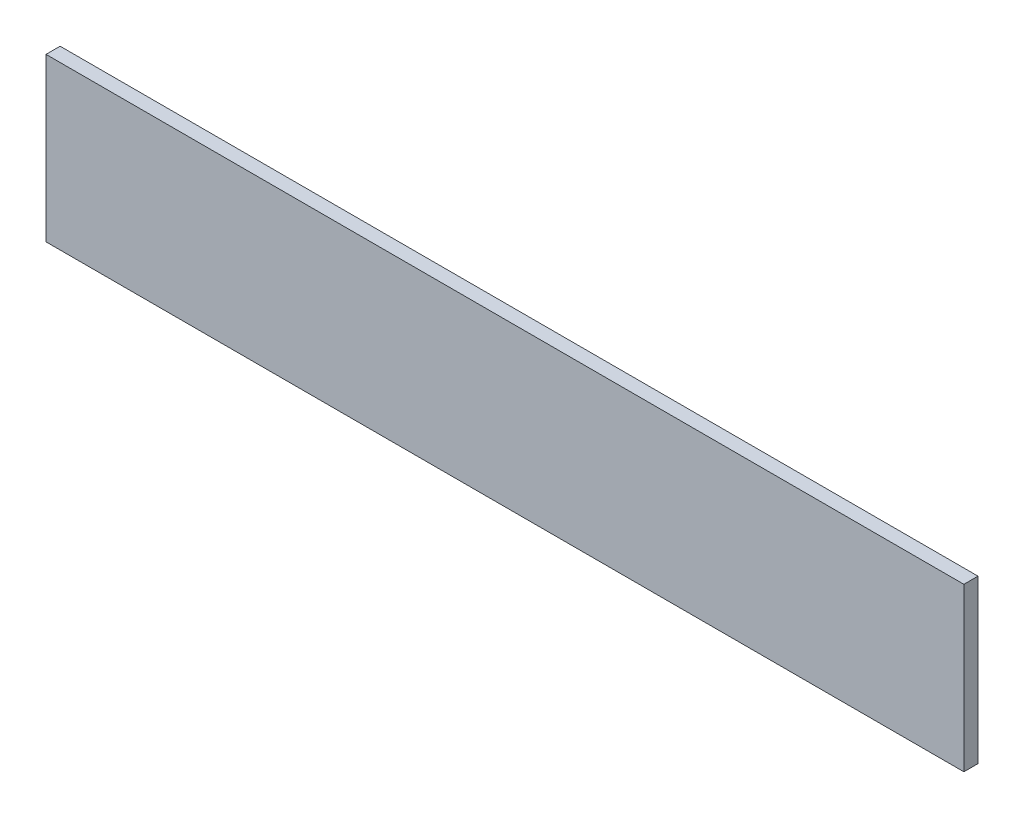
ISO-10303-21;
HEADER;
FILE_DESCRIPTION(('STEP AP214'),'2;1');
FILE_NAME('part.step','',(''),(''),'','','');
FILE_SCHEMA(('AUTOMOTIVE_DESIGN { 1 0 10303 214 1 1 1 1 }'));
ENDSEC;
DATA;
#1=APPLICATION_CONTEXT('core data for automotive mechanical design processes');
#2=APPLICATION_PROTOCOL_DEFINITION('international standard','automotive_design',2000,#1);
#3=PRODUCT_CONTEXT('',#1,'mechanical');
#4=PRODUCT('Part','Part','',(#3));
#5=PRODUCT_RELATED_PRODUCT_CATEGORY('part','',(#4));
#6=PRODUCT_DEFINITION_FORMATION('','',#4);
#7=PRODUCT_DEFINITION_CONTEXT('part definition',#1,'design');
#8=PRODUCT_DEFINITION('design','',#6,#7);
#9=PRODUCT_DEFINITION_SHAPE('','',#8);
#10=(LENGTH_UNIT() NAMED_UNIT(*) SI_UNIT(.MILLI.,.METRE.));
#11=(NAMED_UNIT(*) PLANE_ANGLE_UNIT() SI_UNIT($,.RADIAN.));
#12=(NAMED_UNIT(*) SI_UNIT($,.STERADIAN.) SOLID_ANGLE_UNIT());
#13=UNCERTAINTY_MEASURE_WITH_UNIT(LENGTH_MEASURE(1.E-05),#10,'distance_accuracy_value','');
#14=(GEOMETRIC_REPRESENTATION_CONTEXT(3) GLOBAL_UNCERTAINTY_ASSIGNED_CONTEXT((#13)) GLOBAL_UNIT_ASSIGNED_CONTEXT((#10,
#11,#12)) REPRESENTATION_CONTEXT('',''));
#15=CARTESIAN_POINT('',(0.,0.,0.));
#16=DIRECTION('',(0.,0.,1.));
#17=DIRECTION('',(1.,0.,0.));
#18=AXIS2_PLACEMENT_3D('',#15,#16,#17);
#19=CARTESIAN_POINT('',(0.,0.,4.));
#20=DIRECTION('',(1.,0.,0.));
#21=DIRECTION('',(0.,0.,-1.));
#22=AXIS2_PLACEMENT_3D('',#19,#20,#21);
#23=PLANE('',#22);
#24=DIRECTION('',(0.,-1.,0.));
#25=VECTOR('',#24,1.);
#26=CARTESIAN_POINT('',(0.,0.,0.));
#27=LINE('',#26,#25);
#28=CARTESIAN_POINT('',(0.,46.,0.));
#29=VERTEX_POINT('',#28);
#30=CARTESIAN_POINT('',(0.,0.,0.));
#31=VERTEX_POINT('',#30);
#32=EDGE_CURVE('E95',#29,#31,#27,.T.);
#33=ORIENTED_EDGE('',*,*,#32,.T.);
#34=DIRECTION('',(0.,0.,-1.));
#35=VECTOR('',#34,1.);
#36=CARTESIAN_POINT('',(0.,0.,4.));
#37=LINE('',#36,#35);
#38=CARTESIAN_POINT('',(0.,0.,4.));
#39=VERTEX_POINT('',#38);
#40=EDGE_CURVE('E11',#39,#31,#37,.T.);
#41=ORIENTED_EDGE('',*,*,#40,.F.);
#42=DIRECTION('',(0.,-1.,0.));
#43=VECTOR('',#42,1.);
#44=CARTESIAN_POINT('',(0.,0.,4.));
#45=LINE('',#44,#43);
#46=CARTESIAN_POINT('',(0.,46.,4.));
#47=VERTEX_POINT('',#46);
#48=EDGE_CURVE('E83',#47,#39,#45,.T.);
#49=ORIENTED_EDGE('',*,*,#48,.F.);
#50=DIRECTION('',(0.,0.,-1.));
#51=VECTOR('',#50,1.);
#52=CARTESIAN_POINT('',(0.,46.,4.));
#53=LINE('',#52,#51);
#54=EDGE_CURVE('E91',#47,#29,#53,.T.);
#55=ORIENTED_EDGE('',*,*,#54,.T.);
#56=EDGE_LOOP('',(#33,#41,#49,#55));
#57=FACE_BOUND('',#56,.T.);
#58=ADVANCED_FACE('F32',(#57),#23,.F.);
#59=CARTESIAN_POINT('',(0.,0.,4.));
#60=DIRECTION('',(0.,1.,0.));
#61=DIRECTION('',(0.,0.,1.));
#62=AXIS2_PLACEMENT_3D('',#59,#60,#61);
#63=PLANE('',#62);
#64=DIRECTION('',(1.,0.,0.));
#65=VECTOR('',#64,1.);
#66=CARTESIAN_POINT('',(0.,0.,0.));
#67=LINE('',#66,#65);
#68=CARTESIAN_POINT('',(260.,0.,0.));
#69=VERTEX_POINT('',#68);
#70=EDGE_CURVE('E87',#31,#69,#67,.T.);
#71=ORIENTED_EDGE('',*,*,#70,.T.);
#72=DIRECTION('',(0.,0.,-1.));
#73=VECTOR('',#72,1.);
#74=CARTESIAN_POINT('',(260.,0.,4.));
#75=LINE('',#74,#73);
#76=CARTESIAN_POINT('',(260.,0.,4.));
#77=VERTEX_POINT('',#76);
#78=EDGE_CURVE('E40',#77,#69,#75,.T.);
#79=ORIENTED_EDGE('',*,*,#78,.F.);
#80=DIRECTION('',(1.,0.,0.));
#81=VECTOR('',#80,1.);
#82=CARTESIAN_POINT('',(0.,0.,4.));
#83=LINE('',#82,#81);
#84=EDGE_CURVE('E78',#39,#77,#83,.T.);
#85=ORIENTED_EDGE('',*,*,#84,.F.);
#86=ORIENTED_EDGE('',*,*,#40,.T.);
#87=EDGE_LOOP('',(#71,#79,#85,#86));
#88=FACE_BOUND('',#87,.T.);
#89=ADVANCED_FACE('F86',(#88),#63,.F.);
#90=CARTESIAN_POINT('',(260.,0.,4.));
#91=DIRECTION('',(-1.,0.,0.));
#92=DIRECTION('',(0.,0.,1.));
#93=AXIS2_PLACEMENT_3D('',#90,#91,#92);
#94=PLANE('',#93);
#95=DIRECTION('',(0.,1.,0.));
#96=VECTOR('',#95,1.);
#97=CARTESIAN_POINT('',(260.,0.,0.));
#98=LINE('',#97,#96);
#99=CARTESIAN_POINT('',(260.,46.,0.));
#100=VERTEX_POINT('',#99);
#101=EDGE_CURVE('E65',#69,#100,#98,.T.);
#102=ORIENTED_EDGE('',*,*,#101,.T.);
#103=DIRECTION('',(0.,0.,-1.));
#104=VECTOR('',#103,1.);
#105=CARTESIAN_POINT('',(260.,46.,4.));
#106=LINE('',#105,#104);
#107=CARTESIAN_POINT('',(260.,46.,4.));
#108=VERTEX_POINT('',#107);
#109=EDGE_CURVE('E88',#108,#100,#106,.T.);
#110=ORIENTED_EDGE('',*,*,#109,.F.);
#111=DIRECTION('',(0.,1.,0.));
#112=VECTOR('',#111,1.);
#113=CARTESIAN_POINT('',(260.,0.,4.));
#114=LINE('',#113,#112);
#115=EDGE_CURVE('E81',#77,#108,#114,.T.);
#116=ORIENTED_EDGE('',*,*,#115,.F.);
#117=ORIENTED_EDGE('',*,*,#78,.T.);
#118=EDGE_LOOP('',(#102,#110,#116,#117));
#119=FACE_BOUND('',#118,.T.);
#120=ADVANCED_FACE('F89',(#119),#94,.F.);
#121=CARTESIAN_POINT('',(0.,46.,4.));
#122=DIRECTION('',(0.,-1.,0.));
#123=DIRECTION('',(0.,0.,-1.));
#124=AXIS2_PLACEMENT_3D('',#121,#122,#123);
#125=PLANE('',#124);
#126=DIRECTION('',(-1.,0.,0.));
#127=VECTOR('',#126,1.);
#128=CARTESIAN_POINT('',(0.,46.,0.));
#129=LINE('',#128,#127);
#130=EDGE_CURVE('E71',#100,#29,#129,.T.);
#131=ORIENTED_EDGE('',*,*,#130,.T.);
#132=ORIENTED_EDGE('',*,*,#54,.F.);
#133=DIRECTION('',(-1.,0.,0.));
#134=VECTOR('',#133,1.);
#135=CARTESIAN_POINT('',(0.,46.,4.));
#136=LINE('',#135,#134);
#137=EDGE_CURVE('E48',#108,#47,#136,.T.);
#138=ORIENTED_EDGE('',*,*,#137,.F.);
#139=ORIENTED_EDGE('',*,*,#109,.T.);
#140=EDGE_LOOP('',(#131,#132,#138,#139));
#141=FACE_BOUND('',#140,.T.);
#142=ADVANCED_FACE('F102',(#141),#125,.F.);
#143=CARTESIAN_POINT('',(0.,46.,4.));
#144=DIRECTION('',(0.,0.,-1.));
#145=DIRECTION('',(-1.,0.,0.));
#146=AXIS2_PLACEMENT_3D('',#143,#144,#145);
#147=PLANE('',#146);
#148=ORIENTED_EDGE('',*,*,#48,.T.);
#149=ORIENTED_EDGE('',*,*,#84,.T.);
#150=ORIENTED_EDGE('',*,*,#115,.T.);
#151=ORIENTED_EDGE('',*,*,#137,.T.);
#152=EDGE_LOOP('',(#148,#149,#150,#151));
#153=FACE_BOUND('',#152,.T.);
#154=ADVANCED_FACE('F79',(#153),#147,.F.);
#155=CARTESIAN_POINT('',(0.,46.,0.));
#156=DIRECTION('',(0.,0.,-1.));
#157=DIRECTION('',(-1.,0.,0.));
#158=AXIS2_PLACEMENT_3D('',#155,#156,#157);
#159=PLANE('',#158);
#160=ORIENTED_EDGE('',*,*,#32,.F.);
#161=ORIENTED_EDGE('',*,*,#130,.F.);
#162=ORIENTED_EDGE('',*,*,#101,.F.);
#163=ORIENTED_EDGE('',*,*,#70,.F.);
#164=EDGE_LOOP('',(#160,#161,#162,#163));
#165=FACE_BOUND('',#164,.T.);
#166=ADVANCED_FACE('F105',(#165),#159,.T.);
#167=CLOSED_SHELL('',(#58,#89,#120,#142,#154,#166));
#168=MANIFOLD_SOLID_BREP('B2',#167);
#169=ADVANCED_BREP_SHAPE_REPRESENTATION('',(#18,#168),#14);
#170=SHAPE_DEFINITION_REPRESENTATION(#9,#169);
ENDSEC;
END-ISO-10303-21;
